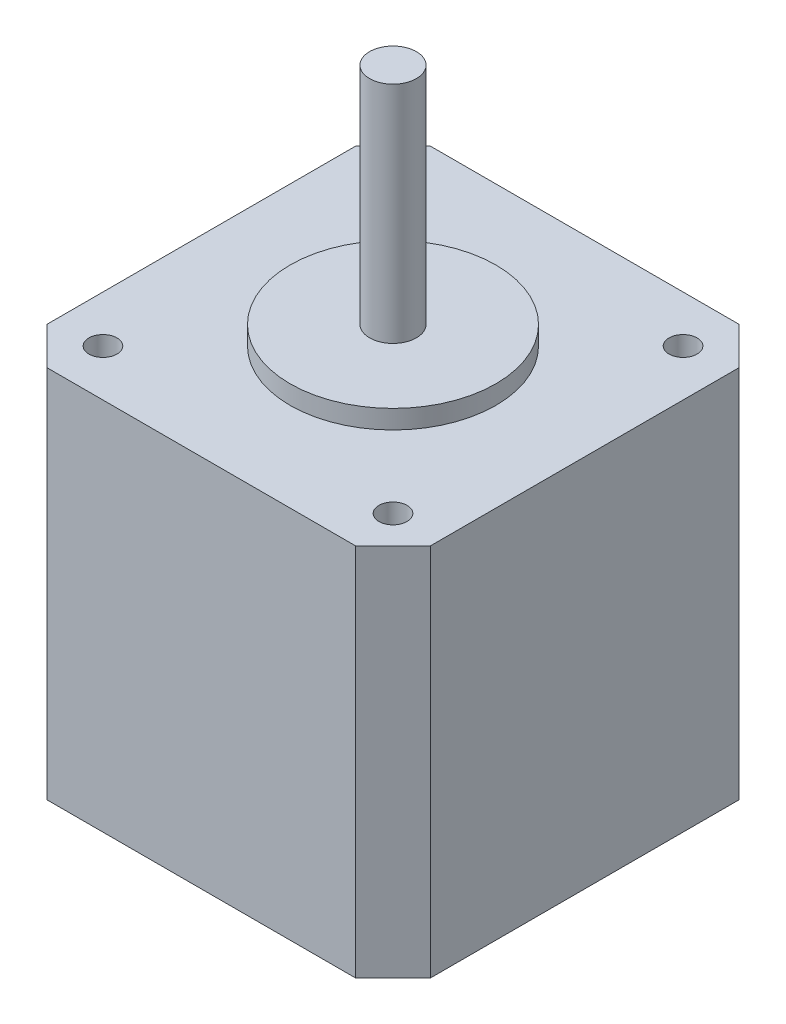
ISO-10303-21;
HEADER;
FILE_DESCRIPTION(('STEP AP214'),'2;1');
FILE_NAME('part.step','',(''),(''),'','','');
FILE_SCHEMA(('AUTOMOTIVE_DESIGN { 1 0 10303 214 1 1 1 1 }'));
ENDSEC;
DATA;
#1=APPLICATION_CONTEXT('core data for automotive mechanical design processes');
#2=APPLICATION_PROTOCOL_DEFINITION('international standard','automotive_design',2000,#1);
#3=PRODUCT_CONTEXT('',#1,'mechanical');
#4=PRODUCT('Part','Part','',(#3));
#5=PRODUCT_RELATED_PRODUCT_CATEGORY('part','',(#4));
#6=PRODUCT_DEFINITION_FORMATION('','',#4);
#7=PRODUCT_DEFINITION_CONTEXT('part definition',#1,'design');
#8=PRODUCT_DEFINITION('design','',#6,#7);
#9=PRODUCT_DEFINITION_SHAPE('','',#8);
#10=(LENGTH_UNIT() NAMED_UNIT(*) SI_UNIT(.MILLI.,.METRE.));
#11=(NAMED_UNIT(*) PLANE_ANGLE_UNIT() SI_UNIT($,.RADIAN.));
#12=(NAMED_UNIT(*) SI_UNIT($,.STERADIAN.) SOLID_ANGLE_UNIT());
#13=UNCERTAINTY_MEASURE_WITH_UNIT(LENGTH_MEASURE(1.E-05),#10,'distance_accuracy_value','');
#14=(GEOMETRIC_REPRESENTATION_CONTEXT(3) GLOBAL_UNCERTAINTY_ASSIGNED_CONTEXT((#13)) GLOBAL_UNIT_ASSIGNED_CONTEXT((#10,
#11,#12)) REPRESENTATION_CONTEXT('',''));
#15=CARTESIAN_POINT('',(0.,0.,0.));
#16=DIRECTION('',(0.,0.,1.));
#17=DIRECTION('',(1.,0.,0.));
#18=AXIS2_PLACEMENT_3D('',#15,#16,#17);
#19=CARTESIAN_POINT('',(16.5,40.,-20.5));
#20=DIRECTION('',(0.,0.,1.));
#21=DIRECTION('',(1.,0.,0.));
#22=AXIS2_PLACEMENT_3D('',#19,#20,#21);
#23=PLANE('',#22);
#24=DIRECTION('',(-1.,0.,0.));
#25=VECTOR('',#24,1.);
#26=CARTESIAN_POINT('',(16.5,0.,-20.5));
#27=LINE('',#26,#25);
#28=CARTESIAN_POINT('',(16.5,0.,-20.5));
#29=VERTEX_POINT('',#28);
#30=CARTESIAN_POINT('',(-16.5,0.,-20.5));
#31=VERTEX_POINT('',#30);
#32=EDGE_CURVE('E143',#29,#31,#27,.T.);
#33=ORIENTED_EDGE('',*,*,#32,.T.);
#34=DIRECTION('',(0.,-1.,0.));
#35=VECTOR('',#34,1.);
#36=CARTESIAN_POINT('',(-16.5,40.,-20.5));
#37=LINE('',#36,#35);
#38=CARTESIAN_POINT('',(-16.5,40.,-20.5));
#39=VERTEX_POINT('',#38);
#40=EDGE_CURVE('E47',#39,#31,#37,.T.);
#41=ORIENTED_EDGE('',*,*,#40,.F.);
#42=DIRECTION('',(-1.,0.,0.));
#43=VECTOR('',#42,1.);
#44=CARTESIAN_POINT('',(16.5,40.,-20.5));
#45=LINE('',#44,#43);
#46=CARTESIAN_POINT('',(16.5,40.,-20.5));
#47=VERTEX_POINT('',#46);
#48=EDGE_CURVE('E158',#47,#39,#45,.T.);
#49=ORIENTED_EDGE('',*,*,#48,.F.);
#50=DIRECTION('',(0.,-1.,0.));
#51=VECTOR('',#50,1.);
#52=CARTESIAN_POINT('',(16.5,40.,-20.5));
#53=LINE('',#52,#51);
#54=EDGE_CURVE('E139',#47,#29,#53,.T.);
#55=ORIENTED_EDGE('',*,*,#54,.T.);
#56=EDGE_LOOP('',(#33,#41,#49,#55));
#57=FACE_BOUND('',#56,.T.);
#58=ADVANCED_FACE('F44',(#57),#23,.F.);
#59=CARTESIAN_POINT('',(-16.5,40.,-20.5));
#60=DIRECTION('',(0.707106781186547,0.,0.707106781186548));
#61=DIRECTION('',(0.707106781186548,0.,-0.707106781186547));
#62=AXIS2_PLACEMENT_3D('',#59,#60,#61);
#63=PLANE('',#62);
#64=DIRECTION('',(-0.707106781186548,0.,0.707106781186547));
#65=VECTOR('',#64,1.);
#66=CARTESIAN_POINT('',(-16.5,0.,-20.5));
#67=LINE('',#66,#65);
#68=CARTESIAN_POINT('',(-20.5,0.,-16.5));
#69=VERTEX_POINT('',#68);
#70=EDGE_CURVE('E146',#31,#69,#67,.T.);
#71=ORIENTED_EDGE('',*,*,#70,.T.);
#72=DIRECTION('',(0.,-1.,0.));
#73=VECTOR('',#72,1.);
#74=CARTESIAN_POINT('',(-20.5,40.,-16.5));
#75=LINE('',#74,#73);
#76=CARTESIAN_POINT('',(-20.5,40.,-16.5));
#77=VERTEX_POINT('',#76);
#78=EDGE_CURVE('E167',#77,#69,#75,.T.);
#79=ORIENTED_EDGE('',*,*,#78,.F.);
#80=DIRECTION('',(-0.707106781186548,0.,0.707106781186547));
#81=VECTOR('',#80,1.);
#82=CARTESIAN_POINT('',(-16.5,40.,-20.5));
#83=LINE('',#82,#81);
#84=EDGE_CURVE('E106',#39,#77,#83,.T.);
#85=ORIENTED_EDGE('',*,*,#84,.F.);
#86=ORIENTED_EDGE('',*,*,#40,.T.);
#87=EDGE_LOOP('',(#71,#79,#85,#86));
#88=FACE_BOUND('',#87,.T.);
#89=ADVANCED_FACE('F210',(#88),#63,.F.);
#90=CARTESIAN_POINT('',(-20.5,40.,-16.5));
#91=DIRECTION('',(1.,0.,0.));
#92=DIRECTION('',(0.,0.,-1.));
#93=AXIS2_PLACEMENT_3D('',#90,#91,#92);
#94=PLANE('',#93);
#95=DIRECTION('',(0.,0.,1.));
#96=VECTOR('',#95,1.);
#97=CARTESIAN_POINT('',(-20.5,0.,-16.5));
#98=LINE('',#97,#96);
#99=CARTESIAN_POINT('',(-20.5,0.,16.5));
#100=VERTEX_POINT('',#99);
#101=EDGE_CURVE('E149',#69,#100,#98,.T.);
#102=ORIENTED_EDGE('',*,*,#101,.T.);
#103=DIRECTION('',(0.,-1.,0.));
#104=VECTOR('',#103,1.);
#105=CARTESIAN_POINT('',(-20.5,40.,16.5));
#106=LINE('',#105,#104);
#107=CARTESIAN_POINT('',(-20.5,40.,16.5));
#108=VERTEX_POINT('',#107);
#109=EDGE_CURVE('E165',#108,#100,#106,.T.);
#110=ORIENTED_EDGE('',*,*,#109,.F.);
#111=DIRECTION('',(0.,0.,1.));
#112=VECTOR('',#111,1.);
#113=CARTESIAN_POINT('',(-20.5,40.,-16.5));
#114=LINE('',#113,#112);
#115=EDGE_CURVE('E181',#77,#108,#114,.T.);
#116=ORIENTED_EDGE('',*,*,#115,.F.);
#117=ORIENTED_EDGE('',*,*,#78,.T.);
#118=EDGE_LOOP('',(#102,#110,#116,#117));
#119=FACE_BOUND('',#118,.T.);
#120=ADVANCED_FACE('F214',(#119),#94,.F.);
#121=CARTESIAN_POINT('',(-16.5,40.,20.5));
#122=DIRECTION('',(0.707106781186547,0.,-0.707106781186548));
#123=DIRECTION('',(-0.707106781186548,0.,-0.707106781186547));
#124=AXIS2_PLACEMENT_3D('',#121,#122,#123);
#125=PLANE('',#124);
#126=DIRECTION('',(0.707106781186548,0.,0.707106781186547));
#127=VECTOR('',#126,1.);
#128=CARTESIAN_POINT('',(-16.5,0.,20.5));
#129=LINE('',#128,#127);
#130=CARTESIAN_POINT('',(-16.5,0.,20.5));
#131=VERTEX_POINT('',#130);
#132=EDGE_CURVE('E151',#100,#131,#129,.T.);
#133=ORIENTED_EDGE('',*,*,#132,.T.);
#134=DIRECTION('',(0.,-1.,0.));
#135=VECTOR('',#134,1.);
#136=CARTESIAN_POINT('',(-16.5,40.,20.5));
#137=LINE('',#136,#135);
#138=CARTESIAN_POINT('',(-16.5,40.,20.5));
#139=VERTEX_POINT('',#138);
#140=EDGE_CURVE('E162',#139,#131,#137,.T.);
#141=ORIENTED_EDGE('',*,*,#140,.F.);
#142=DIRECTION('',(0.707106781186548,0.,0.707106781186547));
#143=VECTOR('',#142,1.);
#144=CARTESIAN_POINT('',(-16.5,40.,20.5));
#145=LINE('',#144,#143);
#146=EDGE_CURVE('E183',#108,#139,#145,.T.);
#147=ORIENTED_EDGE('',*,*,#146,.F.);
#148=ORIENTED_EDGE('',*,*,#109,.T.);
#149=EDGE_LOOP('',(#133,#141,#147,#148));
#150=FACE_BOUND('',#149,.T.);
#151=ADVANCED_FACE('F188',(#150),#125,.F.);
#152=CARTESIAN_POINT('',(16.5,40.,20.5));
#153=DIRECTION('',(0.,0.,-1.));
#154=DIRECTION('',(-1.,0.,0.));
#155=AXIS2_PLACEMENT_3D('',#152,#153,#154);
#156=PLANE('',#155);
#157=DIRECTION('',(1.,0.,0.));
#158=VECTOR('',#157,1.);
#159=CARTESIAN_POINT('',(16.5,0.,20.5));
#160=LINE('',#159,#158);
#161=CARTESIAN_POINT('',(16.5,0.,20.5));
#162=VERTEX_POINT('',#161);
#163=EDGE_CURVE('E153',#131,#162,#160,.T.);
#164=ORIENTED_EDGE('',*,*,#163,.T.);
#165=DIRECTION('',(0.,-1.,0.));
#166=VECTOR('',#165,1.);
#167=CARTESIAN_POINT('',(16.5,40.,20.5));
#168=LINE('',#167,#166);
#169=CARTESIAN_POINT('',(16.5,40.,20.5));
#170=VERTEX_POINT('',#169);
#171=EDGE_CURVE('E134',#170,#162,#168,.T.);
#172=ORIENTED_EDGE('',*,*,#171,.F.);
#173=DIRECTION('',(1.,0.,0.));
#174=VECTOR('',#173,1.);
#175=CARTESIAN_POINT('',(16.5,40.,20.5));
#176=LINE('',#175,#174);
#177=EDGE_CURVE('E125',#139,#170,#176,.T.);
#178=ORIENTED_EDGE('',*,*,#177,.F.);
#179=ORIENTED_EDGE('',*,*,#140,.T.);
#180=EDGE_LOOP('',(#164,#172,#178,#179));
#181=FACE_BOUND('',#180,.T.);
#182=ADVANCED_FACE('F192',(#181),#156,.F.);
#183=CARTESIAN_POINT('',(20.5,40.,16.5));
#184=DIRECTION('',(-0.707106781186547,0.,-0.707106781186548));
#185=DIRECTION('',(-0.707106781186548,0.,0.707106781186547));
#186=AXIS2_PLACEMENT_3D('',#183,#184,#185);
#187=PLANE('',#186);
#188=DIRECTION('',(0.707106781186548,0.,-0.707106781186547));
#189=VECTOR('',#188,1.);
#190=CARTESIAN_POINT('',(20.5,0.,16.5));
#191=LINE('',#190,#189);
#192=CARTESIAN_POINT('',(20.5,0.,16.5));
#193=VERTEX_POINT('',#192);
#194=EDGE_CURVE('E133',#162,#193,#191,.T.);
#195=ORIENTED_EDGE('',*,*,#194,.T.);
#196=DIRECTION('',(0.,-1.,0.));
#197=VECTOR('',#196,1.);
#198=CARTESIAN_POINT('',(20.5,40.,16.5));
#199=LINE('',#198,#197);
#200=CARTESIAN_POINT('',(20.5,40.,16.5));
#201=VERTEX_POINT('',#200);
#202=EDGE_CURVE('E130',#201,#193,#199,.T.);
#203=ORIENTED_EDGE('',*,*,#202,.F.);
#204=DIRECTION('',(0.707106781186548,0.,-0.707106781186547));
#205=VECTOR('',#204,1.);
#206=CARTESIAN_POINT('',(20.5,40.,16.5));
#207=LINE('',#206,#205);
#208=EDGE_CURVE('E119',#170,#201,#207,.T.);
#209=ORIENTED_EDGE('',*,*,#208,.F.);
#210=ORIENTED_EDGE('',*,*,#171,.T.);
#211=EDGE_LOOP('',(#195,#203,#209,#210));
#212=FACE_BOUND('',#211,.T.);
#213=ADVANCED_FACE('F131',(#212),#187,.F.);
#214=CARTESIAN_POINT('',(20.5,40.,-16.5));
#215=DIRECTION('',(-1.,0.,0.));
#216=DIRECTION('',(0.,0.,1.));
#217=AXIS2_PLACEMENT_3D('',#214,#215,#216);
#218=PLANE('',#217);
#219=DIRECTION('',(0.,0.,-1.));
#220=VECTOR('',#219,1.);
#221=CARTESIAN_POINT('',(20.5,0.,-16.5));
#222=LINE('',#221,#220);
#223=CARTESIAN_POINT('',(20.5,0.,-16.5));
#224=VERTEX_POINT('',#223);
#225=EDGE_CURVE('E91',#193,#224,#222,.T.);
#226=ORIENTED_EDGE('',*,*,#225,.T.);
#227=DIRECTION('',(0.,-1.,0.));
#228=VECTOR('',#227,1.);
#229=CARTESIAN_POINT('',(20.5,40.,-16.5));
#230=LINE('',#229,#228);
#231=CARTESIAN_POINT('',(20.5,40.,-16.5));
#232=VERTEX_POINT('',#231);
#233=EDGE_CURVE('E135',#232,#224,#230,.T.);
#234=ORIENTED_EDGE('',*,*,#233,.F.);
#235=DIRECTION('',(0.,0.,-1.));
#236=VECTOR('',#235,1.);
#237=CARTESIAN_POINT('',(20.5,40.,-16.5));
#238=LINE('',#237,#236);
#239=EDGE_CURVE('E123',#201,#232,#238,.T.);
#240=ORIENTED_EDGE('',*,*,#239,.F.);
#241=ORIENTED_EDGE('',*,*,#202,.T.);
#242=EDGE_LOOP('',(#226,#234,#240,#241));
#243=FACE_BOUND('',#242,.T.);
#244=ADVANCED_FACE('F137',(#243),#218,.F.);
#245=CARTESIAN_POINT('',(20.5,40.,-16.5));
#246=DIRECTION('',(-0.707106781186548,0.,0.707106781186548));
#247=DIRECTION('',(0.707106781186548,0.,0.707106781186548));
#248=AXIS2_PLACEMENT_3D('',#245,#246,#247);
#249=PLANE('',#248);
#250=DIRECTION('',(-0.707106781186548,0.,-0.707106781186548));
#251=VECTOR('',#250,1.);
#252=CARTESIAN_POINT('',(20.5,0.,-16.5));
#253=LINE('',#252,#251);
#254=EDGE_CURVE('E97',#224,#29,#253,.T.);
#255=ORIENTED_EDGE('',*,*,#254,.T.);
#256=ORIENTED_EDGE('',*,*,#54,.F.);
#257=DIRECTION('',(-0.707106781186548,0.,-0.707106781186548));
#258=VECTOR('',#257,1.);
#259=CARTESIAN_POINT('',(20.5,40.,-16.5));
#260=LINE('',#259,#258);
#261=EDGE_CURVE('E62',#232,#47,#260,.T.);
#262=ORIENTED_EDGE('',*,*,#261,.F.);
#263=ORIENTED_EDGE('',*,*,#233,.T.);
#264=EDGE_LOOP('',(#255,#256,#262,#263));
#265=FACE_BOUND('',#264,.T.);
#266=ADVANCED_FACE('F198',(#265),#249,.F.);
#267=CARTESIAN_POINT('',(0.,40.,0.));
#268=DIRECTION('',(0.,1.,0.));
#269=DIRECTION('',(0.,0.,1.));
#270=AXIS2_PLACEMENT_3D('',#267,#268,#269);
#271=PLANE('',#270);
#272=CARTESIAN_POINT('',(-15.5,40.,15.5));
#273=DIRECTION('',(0.,1.,0.));
#274=DIRECTION('',(0.,0.,1.));
#275=AXIS2_PLACEMENT_3D('',#272,#273,#274);
#276=CIRCLE('',#275,1.5);
#277=CARTESIAN_POINT('',(-15.5,40.,17.));
#278=VERTEX_POINT('',#277);
#279=EDGE_CURVE('E378',#278,#278,#276,.T.);
#280=ORIENTED_EDGE('',*,*,#279,.F.);
#281=EDGE_LOOP('',(#280));
#282=FACE_BOUND('',#281,.T.);
#283=CARTESIAN_POINT('',(15.5,40.,15.5));
#284=DIRECTION('',(0.,1.,0.));
#285=DIRECTION('',(0.,0.,1.));
#286=AXIS2_PLACEMENT_3D('',#283,#284,#285);
#287=CIRCLE('',#286,1.5);
#288=CARTESIAN_POINT('',(15.5,40.,17.));
#289=VERTEX_POINT('',#288);
#290=EDGE_CURVE('E377',#289,#289,#287,.T.);
#291=ORIENTED_EDGE('',*,*,#290,.F.);
#292=EDGE_LOOP('',(#291));
#293=FACE_BOUND('',#292,.T.);
#294=CARTESIAN_POINT('',(15.5,40.,-15.5));
#295=DIRECTION('',(0.,1.,0.));
#296=DIRECTION('',(0.,0.,1.));
#297=AXIS2_PLACEMENT_3D('',#294,#295,#296);
#298=CIRCLE('',#297,1.5);
#299=CARTESIAN_POINT('',(15.5,40.,-14.));
#300=VERTEX_POINT('',#299);
#301=EDGE_CURVE('E405',#300,#300,#298,.T.);
#302=ORIENTED_EDGE('',*,*,#301,.F.);
#303=EDGE_LOOP('',(#302));
#304=FACE_BOUND('',#303,.T.);
#305=CARTESIAN_POINT('',(-15.5,40.,-15.5));
#306=DIRECTION('',(0.,1.,0.));
#307=DIRECTION('',(0.,0.,1.));
#308=AXIS2_PLACEMENT_3D('',#305,#306,#307);
#309=CIRCLE('',#308,1.5);
#310=CARTESIAN_POINT('',(-15.5,40.,-14.));
#311=VERTEX_POINT('',#310);
#312=EDGE_CURVE('E391',#311,#311,#309,.T.);
#313=ORIENTED_EDGE('',*,*,#312,.F.);
#314=EDGE_LOOP('',(#313));
#315=FACE_BOUND('',#314,.T.);
#316=CARTESIAN_POINT('',(0.,40.,0.));
#317=DIRECTION('',(0.,1.,0.));
#318=DIRECTION('',(0.,0.,1.));
#319=AXIS2_PLACEMENT_3D('',#316,#317,#318);
#320=CIRCLE('',#319,11.);
#321=CARTESIAN_POINT('',(0.,40.,11.));
#322=VERTEX_POINT('',#321);
#323=EDGE_CURVE('E53',#322,#322,#320,.T.);
#324=ORIENTED_EDGE('',*,*,#323,.F.);
#325=EDGE_LOOP('',(#324));
#326=FACE_BOUND('',#325,.T.);
#327=ORIENTED_EDGE('',*,*,#48,.T.);
#328=ORIENTED_EDGE('',*,*,#84,.T.);
#329=ORIENTED_EDGE('',*,*,#115,.T.);
#330=ORIENTED_EDGE('',*,*,#146,.T.);
#331=ORIENTED_EDGE('',*,*,#177,.T.);
#332=ORIENTED_EDGE('',*,*,#208,.T.);
#333=ORIENTED_EDGE('',*,*,#239,.T.);
#334=ORIENTED_EDGE('',*,*,#261,.T.);
#335=EDGE_LOOP('',(#327,#328,#329,#330,#331,#332,#333,#334));
#336=FACE_BOUND('',#335,.T.);
#337=ADVANCED_FACE('F121',(#282,#293,#304,#315,#326,#336),#271,.T.);
#338=CARTESIAN_POINT('',(0.,0.,0.));
#339=DIRECTION('',(0.,1.,0.));
#340=DIRECTION('',(0.,0.,1.));
#341=AXIS2_PLACEMENT_3D('',#338,#339,#340);
#342=PLANE('',#341);
#343=ORIENTED_EDGE('',*,*,#32,.F.);
#344=ORIENTED_EDGE('',*,*,#254,.F.);
#345=ORIENTED_EDGE('',*,*,#225,.F.);
#346=ORIENTED_EDGE('',*,*,#194,.F.);
#347=ORIENTED_EDGE('',*,*,#163,.F.);
#348=ORIENTED_EDGE('',*,*,#132,.F.);
#349=ORIENTED_EDGE('',*,*,#101,.F.);
#350=ORIENTED_EDGE('',*,*,#70,.F.);
#351=EDGE_LOOP('',(#343,#344,#345,#346,#347,#348,#349,#350));
#352=FACE_BOUND('',#351,.T.);
#353=ADVANCED_FACE('F195',(#352),#342,.F.);
#354=CARTESIAN_POINT('',(0.,42.,0.));
#355=DIRECTION('',(0.,-1.,0.));
#356=DIRECTION('',(0.,0.,-1.));
#357=AXIS2_PLACEMENT_3D('',#354,#355,#356);
#358=CYLINDRICAL_SURFACE('',#357,11.);
#359=CARTESIAN_POINT('',(0.,42.,0.));
#360=DIRECTION('',(0.,1.,0.));
#361=DIRECTION('',(0.,0.,1.));
#362=AXIS2_PLACEMENT_3D('',#359,#360,#361);
#363=CIRCLE('',#362,11.);
#364=CARTESIAN_POINT('',(0.,42.,11.));
#365=VERTEX_POINT('',#364);
#366=EDGE_CURVE('E147',#365,#365,#363,.T.);
#367=ORIENTED_EDGE('',*,*,#366,.F.);
#368=EDGE_LOOP('',(#367));
#369=FACE_BOUND('',#368,.T.);
#370=ORIENTED_EDGE('',*,*,#323,.T.);
#371=EDGE_LOOP('',(#370));
#372=FACE_BOUND('',#371,.T.);
#373=ADVANCED_FACE('F247',(#369,#372),#358,.T.);
#374=CARTESIAN_POINT('',(0.,42.,0.));
#375=DIRECTION('',(0.,1.,0.));
#376=DIRECTION('',(0.,0.,1.));
#377=AXIS2_PLACEMENT_3D('',#374,#375,#376);
#378=PLANE('',#377);
#379=CARTESIAN_POINT('',(0.,42.,0.));
#380=DIRECTION('',(0.,1.,0.));
#381=DIRECTION('',(0.,0.,1.));
#382=AXIS2_PLACEMENT_3D('',#379,#380,#381);
#383=CIRCLE('',#382,2.5);
#384=CARTESIAN_POINT('',(0.,42.,2.5));
#385=VERTEX_POINT('',#384);
#386=EDGE_CURVE('E13',#385,#385,#383,.T.);
#387=ORIENTED_EDGE('',*,*,#386,.F.);
#388=EDGE_LOOP('',(#387));
#389=FACE_BOUND('',#388,.T.);
#390=ORIENTED_EDGE('',*,*,#366,.T.);
#391=EDGE_LOOP('',(#390));
#392=FACE_BOUND('',#391,.T.);
#393=ADVANCED_FACE('F255',(#389,#392),#378,.T.);
#394=CARTESIAN_POINT('',(0.,66.,0.));
#395=DIRECTION('',(0.,-1.,0.));
#396=DIRECTION('',(0.,0.,-1.));
#397=AXIS2_PLACEMENT_3D('',#394,#395,#396);
#398=CYLINDRICAL_SURFACE('',#397,2.5);
#399=CARTESIAN_POINT('',(0.,66.,0.));
#400=DIRECTION('',(0.,1.,0.));
#401=DIRECTION('',(0.,0.,1.));
#402=AXIS2_PLACEMENT_3D('',#399,#400,#401);
#403=CIRCLE('',#402,2.5);
#404=CARTESIAN_POINT('',(0.,66.,2.5));
#405=VERTEX_POINT('',#404);
#406=EDGE_CURVE('E390',#405,#405,#403,.T.);
#407=ORIENTED_EDGE('',*,*,#406,.F.);
#408=EDGE_LOOP('',(#407));
#409=FACE_BOUND('',#408,.T.);
#410=ORIENTED_EDGE('',*,*,#386,.T.);
#411=EDGE_LOOP('',(#410));
#412=FACE_BOUND('',#411,.T.);
#413=ADVANCED_FACE('F265',(#409,#412),#398,.T.);
#414=CARTESIAN_POINT('',(0.,66.,0.));
#415=DIRECTION('',(0.,1.,0.));
#416=DIRECTION('',(0.,0.,1.));
#417=AXIS2_PLACEMENT_3D('',#414,#415,#416);
#418=PLANE('',#417);
#419=ORIENTED_EDGE('',*,*,#406,.T.);
#420=EDGE_LOOP('',(#419));
#421=FACE_BOUND('',#420,.T.);
#422=ADVANCED_FACE('F275',(#421),#418,.T.);
#423=CARTESIAN_POINT('',(-15.5,35.,-15.5));
#424=DIRECTION('',(0.,1.,0.));
#425=DIRECTION('',(0.,0.,1.));
#426=AXIS2_PLACEMENT_3D('',#423,#424,#425);
#427=CYLINDRICAL_SURFACE('',#426,1.5);
#428=CARTESIAN_POINT('',(-15.5,35.,-15.5));
#429=DIRECTION('',(0.,1.,0.));
#430=DIRECTION('',(0.,0.,1.));
#431=AXIS2_PLACEMENT_3D('',#428,#429,#430);
#432=CIRCLE('',#431,1.5);
#433=CARTESIAN_POINT('',(-15.5,35.,-14.));
#434=VERTEX_POINT('',#433);
#435=EDGE_CURVE('E387',#434,#434,#432,.T.);
#436=ORIENTED_EDGE('',*,*,#435,.F.);
#437=EDGE_LOOP('',(#436));
#438=FACE_BOUND('',#437,.T.);
#439=ORIENTED_EDGE('',*,*,#312,.T.);
#440=EDGE_LOOP('',(#439));
#441=FACE_BOUND('',#440,.T.);
#442=ADVANCED_FACE('F285',(#438,#441),#427,.F.);
#443=CARTESIAN_POINT('',(-15.5,35.,-15.5));
#444=DIRECTION('',(0.,1.,0.));
#445=DIRECTION('',(0.,0.,1.));
#446=AXIS2_PLACEMENT_3D('',#443,#444,#445);
#447=PLANE('',#446);
#448=ORIENTED_EDGE('',*,*,#435,.T.);
#449=EDGE_LOOP('',(#448));
#450=FACE_BOUND('',#449,.T.);
#451=ADVANCED_FACE('F300',(#450),#447,.T.);
#452=CARTESIAN_POINT('',(15.5,35.,-15.5));
#453=DIRECTION('',(0.,1.,0.));
#454=DIRECTION('',(0.,0.,1.));
#455=AXIS2_PLACEMENT_3D('',#452,#453,#454);
#456=CYLINDRICAL_SURFACE('',#455,1.5);
#457=CARTESIAN_POINT('',(15.5,35.,-15.5));
#458=DIRECTION('',(0.,1.,0.));
#459=DIRECTION('',(0.,0.,1.));
#460=AXIS2_PLACEMENT_3D('',#457,#458,#459);
#461=CIRCLE('',#460,1.5);
#462=CARTESIAN_POINT('',(15.5,35.,-14.));
#463=VERTEX_POINT('',#462);
#464=EDGE_CURVE('E394',#463,#463,#461,.T.);
#465=ORIENTED_EDGE('',*,*,#464,.F.);
#466=EDGE_LOOP('',(#465));
#467=FACE_BOUND('',#466,.T.);
#468=ORIENTED_EDGE('',*,*,#301,.T.);
#469=EDGE_LOOP('',(#468));
#470=FACE_BOUND('',#469,.T.);
#471=ADVANCED_FACE('F310',(#467,#470),#456,.F.);
#472=CARTESIAN_POINT('',(15.5,35.,-15.5));
#473=DIRECTION('',(0.,1.,0.));
#474=DIRECTION('',(0.,0.,1.));
#475=AXIS2_PLACEMENT_3D('',#472,#473,#474);
#476=PLANE('',#475);
#477=ORIENTED_EDGE('',*,*,#464,.T.);
#478=EDGE_LOOP('',(#477));
#479=FACE_BOUND('',#478,.T.);
#480=ADVANCED_FACE('F320',(#479),#476,.T.);
#481=CARTESIAN_POINT('',(15.5,35.,15.5));
#482=DIRECTION('',(0.,1.,0.));
#483=DIRECTION('',(0.,0.,1.));
#484=AXIS2_PLACEMENT_3D('',#481,#482,#483);
#485=CYLINDRICAL_SURFACE('',#484,1.5);
#486=CARTESIAN_POINT('',(15.5,35.,15.5));
#487=DIRECTION('',(0.,1.,0.));
#488=DIRECTION('',(0.,0.,1.));
#489=AXIS2_PLACEMENT_3D('',#486,#487,#488);
#490=CIRCLE('',#489,1.5);
#491=CARTESIAN_POINT('',(15.5,35.,17.));
#492=VERTEX_POINT('',#491);
#493=EDGE_CURVE('E381',#492,#492,#490,.T.);
#494=ORIENTED_EDGE('',*,*,#493,.F.);
#495=EDGE_LOOP('',(#494));
#496=FACE_BOUND('',#495,.T.);
#497=ORIENTED_EDGE('',*,*,#290,.T.);
#498=EDGE_LOOP('',(#497));
#499=FACE_BOUND('',#498,.T.);
#500=ADVANCED_FACE('F330',(#496,#499),#485,.F.);
#501=CARTESIAN_POINT('',(15.5,35.,15.5));
#502=DIRECTION('',(0.,1.,0.));
#503=DIRECTION('',(0.,0.,1.));
#504=AXIS2_PLACEMENT_3D('',#501,#502,#503);
#505=PLANE('',#504);
#506=ORIENTED_EDGE('',*,*,#493,.T.);
#507=EDGE_LOOP('',(#506));
#508=FACE_BOUND('',#507,.T.);
#509=ADVANCED_FACE('F340',(#508),#505,.T.);
#510=CARTESIAN_POINT('',(-15.5,35.,15.5));
#511=DIRECTION('',(0.,1.,0.));
#512=DIRECTION('',(0.,0.,1.));
#513=AXIS2_PLACEMENT_3D('',#510,#511,#512);
#514=CYLINDRICAL_SURFACE('',#513,1.5);
#515=CARTESIAN_POINT('',(-15.5,35.,15.5));
#516=DIRECTION('',(0.,1.,0.));
#517=DIRECTION('',(0.,0.,1.));
#518=AXIS2_PLACEMENT_3D('',#515,#516,#517);
#519=CIRCLE('',#518,1.5);
#520=CARTESIAN_POINT('',(-15.5,35.,17.));
#521=VERTEX_POINT('',#520);
#522=EDGE_CURVE('E376',#521,#521,#519,.T.);
#523=ORIENTED_EDGE('',*,*,#522,.F.);
#524=EDGE_LOOP('',(#523));
#525=FACE_BOUND('',#524,.T.);
#526=ORIENTED_EDGE('',*,*,#279,.T.);
#527=EDGE_LOOP('',(#526));
#528=FACE_BOUND('',#527,.T.);
#529=ADVANCED_FACE('F350',(#525,#528),#514,.F.);
#530=CARTESIAN_POINT('',(-15.5,35.,15.5));
#531=DIRECTION('',(0.,1.,0.));
#532=DIRECTION('',(0.,0.,1.));
#533=AXIS2_PLACEMENT_3D('',#530,#531,#532);
#534=PLANE('',#533);
#535=ORIENTED_EDGE('',*,*,#522,.T.);
#536=EDGE_LOOP('',(#535));
#537=FACE_BOUND('',#536,.T.);
#538=ADVANCED_FACE('F360',(#537),#534,.T.);
#539=CLOSED_SHELL('',(#58,#89,#120,#151,#182,#213,#244,#266,#337,#353,#373,#393,#413,#422,#442,
#451,#471,#480,#500,#509,#529,#538));
#540=MANIFOLD_SOLID_BREP('B2',#539);
#541=ADVANCED_BREP_SHAPE_REPRESENTATION('',(#18,#540),#14);
#542=SHAPE_DEFINITION_REPRESENTATION(#9,#541);
ENDSEC;
END-ISO-10303-21;
